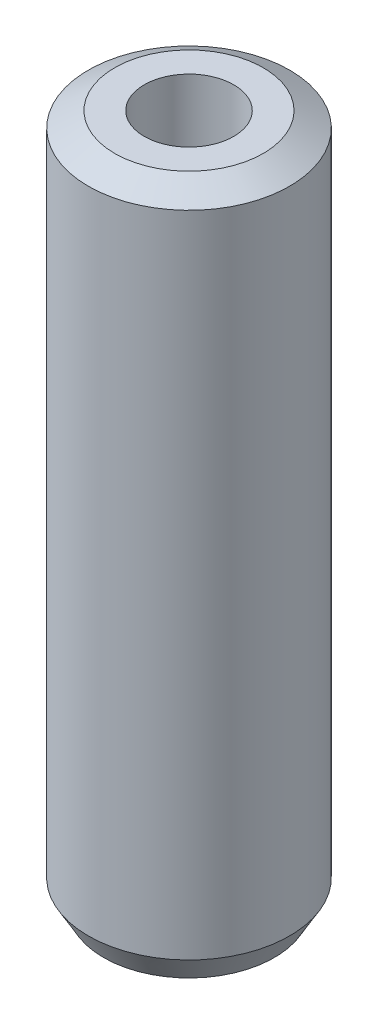
ISO-10303-21;
HEADER;
FILE_DESCRIPTION(('STEP AP214'),'2;1');
FILE_NAME('part.step','',(''),(''),'','','');
FILE_SCHEMA(('AUTOMOTIVE_DESIGN { 1 0 10303 214 1 1 1 1 }'));
ENDSEC;
DATA;
#1=APPLICATION_CONTEXT('core data for automotive mechanical design processes');
#2=APPLICATION_PROTOCOL_DEFINITION('international standard','automotive_design',2000,#1);
#3=PRODUCT_CONTEXT('',#1,'mechanical');
#4=PRODUCT('Part','Part','',(#3));
#5=PRODUCT_RELATED_PRODUCT_CATEGORY('part','',(#4));
#6=PRODUCT_DEFINITION_FORMATION('','',#4);
#7=PRODUCT_DEFINITION_CONTEXT('part definition',#1,'design');
#8=PRODUCT_DEFINITION('design','',#6,#7);
#9=PRODUCT_DEFINITION_SHAPE('','',#8);
#10=(LENGTH_UNIT() NAMED_UNIT(*) SI_UNIT(.MILLI.,.METRE.));
#11=(NAMED_UNIT(*) PLANE_ANGLE_UNIT() SI_UNIT($,.RADIAN.));
#12=(NAMED_UNIT(*) SI_UNIT($,.STERADIAN.) SOLID_ANGLE_UNIT());
#13=UNCERTAINTY_MEASURE_WITH_UNIT(LENGTH_MEASURE(1.E-05),#10,'distance_accuracy_value','');
#14=(GEOMETRIC_REPRESENTATION_CONTEXT(3) GLOBAL_UNCERTAINTY_ASSIGNED_CONTEXT((#13)) GLOBAL_UNIT_ASSIGNED_CONTEXT((#10,
#11,#12)) REPRESENTATION_CONTEXT('',''));
#15=CARTESIAN_POINT('',(0.,0.,0.));
#16=DIRECTION('',(0.,0.,1.));
#17=DIRECTION('',(1.,0.,0.));
#18=AXIS2_PLACEMENT_3D('',#15,#16,#17);
#19=CARTESIAN_POINT('',(0.,68.6372789200277,0.));
#20=DIRECTION('',(0.,-1.,0.));
#21=DIRECTION('',(0.,0.,-1.));
#22=AXIS2_PLACEMENT_3D('',#19,#20,#21);
#23=CYLINDRICAL_SURFACE('',#22,10.);
#24=CARTESIAN_POINT('',(0.,67.1258119224579,0.));
#25=DIRECTION('',(0.,1.,0.));
#26=DIRECTION('',(0.,0.,1.));
#27=AXIS2_PLACEMENT_3D('',#24,#25,#26);
#28=CIRCLE('',#27,10.);
#29=CARTESIAN_POINT('',(0.,67.1258119224579,10.));
#30=VERTEX_POINT('',#29);
#31=EDGE_CURVE('E50',#30,#30,#28,.F.);
#32=ORIENTED_EDGE('',*,*,#31,.T.);
#33=EDGE_LOOP('',(#32));
#34=FACE_BOUND('',#33,.T.);
#35=CARTESIAN_POINT('',(0.,2.61793763375456,0.));
#36=DIRECTION('',(0.,1.,0.));
#37=DIRECTION('',(0.,0.,1.));
#38=AXIS2_PLACEMENT_3D('',#35,#36,#37);
#39=CIRCLE('',#38,10.);
#40=CARTESIAN_POINT('',(0.,2.61793763375456,10.));
#41=VERTEX_POINT('',#40);
#42=EDGE_CURVE('E51',#41,#41,#39,.T.);
#43=ORIENTED_EDGE('',*,*,#42,.T.);
#44=EDGE_LOOP('',(#43));
#45=FACE_BOUND('',#44,.T.);
#46=ADVANCED_FACE('F39',(#34,#45),#23,.T.);
#47=CARTESIAN_POINT('',(0.,68.6372789200277,0.));
#48=DIRECTION('',(0.,1.,0.));
#49=DIRECTION('',(0.,0.,1.));
#50=AXIS2_PLACEMENT_3D('',#47,#48,#49);
#51=PLANE('',#50);
#52=CARTESIAN_POINT('',(0.,68.6372789200277,0.));
#53=DIRECTION('',(0.,1.,0.));
#54=DIRECTION('',(0.,0.,1.));
#55=AXIS2_PLACEMENT_3D('',#52,#53,#54);
#56=CIRCLE('',#55,7.38206236624546);
#57=CARTESIAN_POINT('',(0.,68.6372789200277,7.38206236624546));
#58=VERTEX_POINT('',#57);
#59=EDGE_CURVE('E54',#58,#58,#56,.T.);
#60=ORIENTED_EDGE('',*,*,#59,.T.);
#61=EDGE_LOOP('',(#60));
#62=FACE_BOUND('',#61,.T.);
#63=CARTESIAN_POINT('',(0.,68.6372789200277,0.));
#64=DIRECTION('',(0.,1.,0.));
#65=DIRECTION('',(0.,0.,1.));
#66=AXIS2_PLACEMENT_3D('',#63,#64,#65);
#67=CIRCLE('',#66,4.44703557700813);
#68=CARTESIAN_POINT('',(0.,68.6372789200277,4.44703557700813));
#69=VERTEX_POINT('',#68);
#70=EDGE_CURVE('E58',#69,#69,#67,.T.);
#71=ORIENTED_EDGE('',*,*,#70,.F.);
#72=EDGE_LOOP('',(#71));
#73=FACE_BOUND('',#72,.T.);
#74=ADVANCED_FACE('F69',(#62,#73),#51,.T.);
#75=CARTESIAN_POINT('',(0.,0.,0.));
#76=DIRECTION('',(0.,1.,0.));
#77=DIRECTION('',(0.,0.,1.));
#78=AXIS2_PLACEMENT_3D('',#75,#76,#77);
#79=PLANE('',#78);
#80=CARTESIAN_POINT('',(0.,0.,0.));
#81=DIRECTION('',(0.,1.,0.));
#82=DIRECTION('',(0.,0.,1.));
#83=AXIS2_PLACEMENT_3D('',#80,#81,#82);
#84=CIRCLE('',#83,8.48853300243014);
#85=CARTESIAN_POINT('',(0.,0.,8.48853300243014));
#86=VERTEX_POINT('',#85);
#87=EDGE_CURVE('E10',#86,#86,#84,.F.);
#88=ORIENTED_EDGE('',*,*,#87,.T.);
#89=EDGE_LOOP('',(#88));
#90=FACE_BOUND('',#89,.T.);
#91=CARTESIAN_POINT('',(0.,0.,0.));
#92=DIRECTION('',(0.,1.,0.));
#93=DIRECTION('',(0.,0.,1.));
#94=AXIS2_PLACEMENT_3D('',#91,#92,#93);
#95=CIRCLE('',#94,4.44703557700813);
#96=CARTESIAN_POINT('',(0.,0.,4.44703557700813));
#97=VERTEX_POINT('',#96);
#98=EDGE_CURVE('E63',#97,#97,#95,.T.);
#99=ORIENTED_EDGE('',*,*,#98,.T.);
#100=EDGE_LOOP('',(#99));
#101=FACE_BOUND('',#100,.T.);
#102=ADVANCED_FACE('F75',(#90,#101),#79,.F.);
#103=CARTESIAN_POINT('',(0.,68.6372789200277,0.));
#104=DIRECTION('',(0.,-1.,0.));
#105=DIRECTION('',(0.,0.,-1.));
#106=AXIS2_PLACEMENT_3D('',#103,#104,#105);
#107=CYLINDRICAL_SURFACE('',#106,4.44703557700813);
#108=ORIENTED_EDGE('',*,*,#70,.T.);
#109=EDGE_LOOP('',(#108));
#110=FACE_BOUND('',#109,.T.);
#111=ORIENTED_EDGE('',*,*,#98,.F.);
#112=EDGE_LOOP('',(#111));
#113=FACE_BOUND('',#112,.T.);
#114=ADVANCED_FACE('F70',(#110,#113),#107,.F.);
#115=CARTESIAN_POINT('',(0.,68.6372789200277,0.));
#116=DIRECTION('',(0.,-1.,0.));
#117=DIRECTION('',(0.,0.,-1.));
#118=AXIS2_PLACEMENT_3D('',#115,#116,#117);
#119=CONICAL_SURFACE('',#118,7.38206236624546,1.04719755119659);
#120=ORIENTED_EDGE('',*,*,#31,.F.);
#121=EDGE_LOOP('',(#120));
#122=FACE_BOUND('',#121,.T.);
#123=ORIENTED_EDGE('',*,*,#59,.F.);
#124=EDGE_LOOP('',(#123));
#125=FACE_BOUND('',#124,.T.);
#126=ADVANCED_FACE('F81',(#122,#125),#119,.T.);
#127=CARTESIAN_POINT('',(0.,2.61793763375456,0.));
#128=DIRECTION('',(0.,1.,0.));
#129=DIRECTION('',(0.,0.,1.));
#130=AXIS2_PLACEMENT_3D('',#127,#128,#129);
#131=CONICAL_SURFACE('',#130,10.,0.523598775598302);
#132=ORIENTED_EDGE('',*,*,#87,.F.);
#133=EDGE_LOOP('',(#132));
#134=FACE_BOUND('',#133,.T.);
#135=ORIENTED_EDGE('',*,*,#42,.F.);
#136=EDGE_LOOP('',(#135));
#137=FACE_BOUND('',#136,.T.);
#138=ADVANCED_FACE('F45',(#134,#137),#131,.T.);
#139=CLOSED_SHELL('',(#46,#74,#102,#114,#126,#138));
#140=MANIFOLD_SOLID_BREP('B2',#139);
#141=ADVANCED_BREP_SHAPE_REPRESENTATION('',(#18,#140),#14);
#142=SHAPE_DEFINITION_REPRESENTATION(#9,#141);
ENDSEC;
END-ISO-10303-21;
